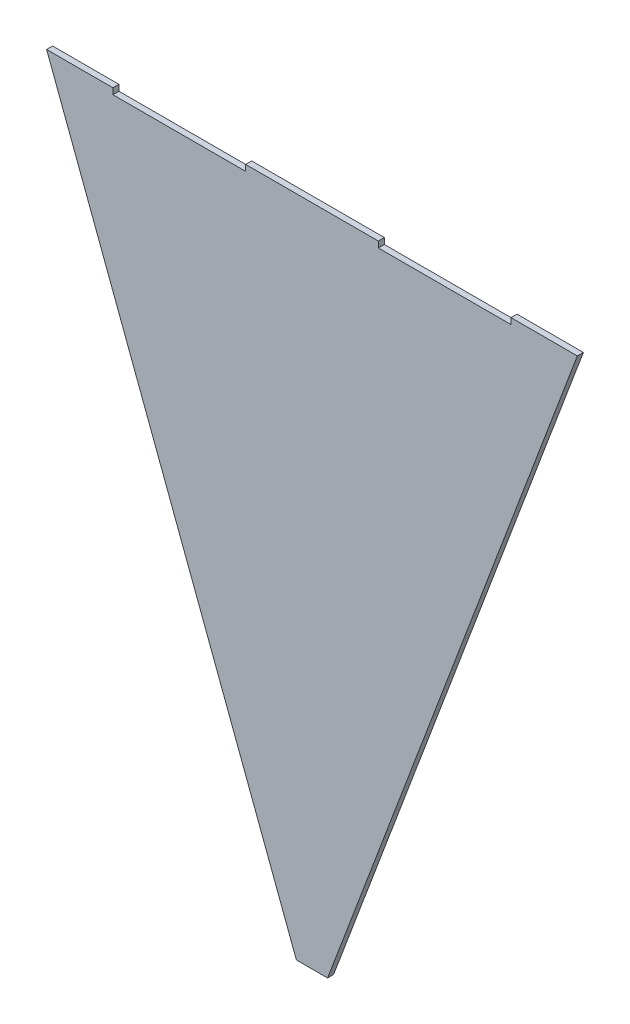
ISO-10303-21;
HEADER;
FILE_DESCRIPTION(('STEP AP214'),'2;1');
FILE_NAME('part.step','',(''),(''),'','','');
FILE_SCHEMA(('AUTOMOTIVE_DESIGN { 1 0 10303 214 1 1 1 1 }'));
ENDSEC;
DATA;
#1=APPLICATION_CONTEXT('core data for automotive mechanical design processes');
#2=APPLICATION_PROTOCOL_DEFINITION('international standard','automotive_design',2000,#1);
#3=PRODUCT_CONTEXT('',#1,'mechanical');
#4=PRODUCT('Part','Part','',(#3));
#5=PRODUCT_RELATED_PRODUCT_CATEGORY('part','',(#4));
#6=PRODUCT_DEFINITION_FORMATION('','',#4);
#7=PRODUCT_DEFINITION_CONTEXT('part definition',#1,'design');
#8=PRODUCT_DEFINITION('design','',#6,#7);
#9=PRODUCT_DEFINITION_SHAPE('','',#8);
#10=(LENGTH_UNIT() NAMED_UNIT(*) SI_UNIT(.MILLI.,.METRE.));
#11=(NAMED_UNIT(*) PLANE_ANGLE_UNIT() SI_UNIT($,.RADIAN.));
#12=(NAMED_UNIT(*) SI_UNIT($,.STERADIAN.) SOLID_ANGLE_UNIT());
#13=UNCERTAINTY_MEASURE_WITH_UNIT(LENGTH_MEASURE(1.E-05),#10,'distance_accuracy_value','');
#14=(GEOMETRIC_REPRESENTATION_CONTEXT(3) GLOBAL_UNCERTAINTY_ASSIGNED_CONTEXT((#13)) GLOBAL_UNIT_ASSIGNED_CONTEXT((#10,
#11,#12)) REPRESENTATION_CONTEXT('',''));
#15=CARTESIAN_POINT('',(0.,0.,0.));
#16=DIRECTION('',(0.,0.,1.));
#17=DIRECTION('',(1.,0.,0.));
#18=AXIS2_PLACEMENT_3D('',#15,#16,#17);
#19=CARTESIAN_POINT('',(-132.0301910025,440.215614172419,4.));
#20=DIRECTION('',(-1.,0.,0.));
#21=DIRECTION('',(0.,0.,1.));
#22=AXIS2_PLACEMENT_3D('',#19,#20,#21);
#23=PLANE('',#22);
#24=DIRECTION('',(0.,1.,0.));
#25=VECTOR('',#24,1.);
#26=CARTESIAN_POINT('',(-132.0301910025,440.215614172419,0.));
#27=LINE('',#26,#25);
#28=CARTESIAN_POINT('',(-132.0301910025,436.215614172419,0.));
#29=VERTEX_POINT('',#28);
#30=CARTESIAN_POINT('',(-132.0301910025,440.215614172419,0.));
#31=VERTEX_POINT('',#30);
#32=EDGE_CURVE('E153',#29,#31,#27,.T.);
#33=ORIENTED_EDGE('',*,*,#32,.T.);
#34=DIRECTION('',(0.,0.,-1.));
#35=VECTOR('',#34,1.);
#36=CARTESIAN_POINT('',(-132.0301910025,440.215614172419,4.));
#37=LINE('',#36,#35);
#38=CARTESIAN_POINT('',(-132.0301910025,440.215614172419,4.));
#39=VERTEX_POINT('',#38);
#40=EDGE_CURVE('E11',#39,#31,#37,.T.);
#41=ORIENTED_EDGE('',*,*,#40,.F.);
#42=DIRECTION('',(0.,1.,0.));
#43=VECTOR('',#42,1.);
#44=CARTESIAN_POINT('',(-132.0301910025,440.215614172419,4.));
#45=LINE('',#44,#43);
#46=CARTESIAN_POINT('',(-132.0301910025,436.215614172419,4.));
#47=VERTEX_POINT('',#46);
#48=EDGE_CURVE('E175',#47,#39,#45,.T.);
#49=ORIENTED_EDGE('',*,*,#48,.F.);
#50=DIRECTION('',(0.,0.,-1.));
#51=VECTOR('',#50,1.);
#52=CARTESIAN_POINT('',(-132.0301910025,436.215614172419,4.));
#53=LINE('',#52,#51);
#54=EDGE_CURVE('E149',#47,#29,#53,.T.);
#55=ORIENTED_EDGE('',*,*,#54,.T.);
#56=EDGE_LOOP('',(#33,#41,#49,#55));
#57=FACE_BOUND('',#56,.T.);
#58=ADVANCED_FACE('F33',(#57),#23,.F.);
#59=CARTESIAN_POINT('',(-176.040382005,440.215614172419,4.));
#60=DIRECTION('',(0.,-1.,0.));
#61=DIRECTION('',(0.,0.,-1.));
#62=AXIS2_PLACEMENT_3D('',#59,#60,#61);
#63=PLANE('',#62);
#64=DIRECTION('',(-1.,0.,0.));
#65=VECTOR('',#64,1.);
#66=CARTESIAN_POINT('',(-176.040382005,440.215614172419,0.));
#67=LINE('',#66,#65);
#68=CARTESIAN_POINT('',(-176.040382005,440.215614172419,0.));
#69=VERTEX_POINT('',#68);
#70=EDGE_CURVE('E156',#31,#69,#67,.T.);
#71=ORIENTED_EDGE('',*,*,#70,.T.);
#72=DIRECTION('',(0.,0.,-1.));
#73=VECTOR('',#72,1.);
#74=CARTESIAN_POINT('',(-176.040382005,440.215614172419,4.));
#75=LINE('',#74,#73);
#76=CARTESIAN_POINT('',(-176.040382005,440.215614172419,4.));
#77=VERTEX_POINT('',#76);
#78=EDGE_CURVE('E41',#77,#69,#75,.T.);
#79=ORIENTED_EDGE('',*,*,#78,.F.);
#80=DIRECTION('',(-1.,0.,0.));
#81=VECTOR('',#80,1.);
#82=CARTESIAN_POINT('',(-176.040382005,440.215614172419,4.));
#83=LINE('',#82,#81);
#84=EDGE_CURVE('E104',#39,#77,#83,.T.);
#85=ORIENTED_EDGE('',*,*,#84,.F.);
#86=ORIENTED_EDGE('',*,*,#40,.T.);
#87=EDGE_LOOP('',(#71,#79,#85,#86));
#88=FACE_BOUND('',#87,.T.);
#89=ADVANCED_FACE('F253',(#88),#63,.F.);
#90=CARTESIAN_POINT('',(-10.35533906,0.,4.));
#91=DIRECTION('',(0.935906194500633,0.352249336543511,0.));
#92=DIRECTION('',(-0.352249336543511,0.935906194500633,0.));
#93=AXIS2_PLACEMENT_3D('',#90,#91,#92);
#94=PLANE('',#93);
#95=DIRECTION('',(0.352249336543511,-0.935906194500633,0.));
#96=VECTOR('',#95,1.);
#97=CARTESIAN_POINT('',(-10.35533906,0.,0.));
#98=LINE('',#97,#96);
#99=CARTESIAN_POINT('',(-10.35533906,0.,0.));
#100=VERTEX_POINT('',#99);
#101=EDGE_CURVE('E158',#69,#100,#98,.T.);
#102=ORIENTED_EDGE('',*,*,#101,.T.);
#103=DIRECTION('',(0.,0.,-1.));
#104=VECTOR('',#103,1.);
#105=CARTESIAN_POINT('',(-10.35533906,0.,4.));
#106=LINE('',#105,#104);
#107=CARTESIAN_POINT('',(-10.35533906,0.,4.));
#108=VERTEX_POINT('',#107);
#109=EDGE_CURVE('E194',#108,#100,#106,.T.);
#110=ORIENTED_EDGE('',*,*,#109,.F.);
#111=DIRECTION('',(0.352249336543511,-0.935906194500633,0.));
#112=VECTOR('',#111,1.);
#113=CARTESIAN_POINT('',(-10.35533906,0.,4.));
#114=LINE('',#113,#112);
#115=EDGE_CURVE('E202',#77,#108,#114,.T.);
#116=ORIENTED_EDGE('',*,*,#115,.F.);
#117=ORIENTED_EDGE('',*,*,#78,.T.);
#118=EDGE_LOOP('',(#102,#110,#116,#117));
#119=FACE_BOUND('',#118,.T.);
#120=ADVANCED_FACE('F200',(#119),#94,.F.);
#121=CARTESIAN_POINT('',(10.35533906,0.,4.));
#122=DIRECTION('',(0.,1.,0.));
#123=DIRECTION('',(-1.,0.,0.));
#124=AXIS2_PLACEMENT_3D('',#121,#122,#123);
#125=PLANE('',#124);
#126=DIRECTION('',(1.,0.,0.));
#127=VECTOR('',#126,1.);
#128=CARTESIAN_POINT('',(10.35533906,0.,0.));
#129=LINE('',#128,#127);
#130=CARTESIAN_POINT('',(10.35533906,0.,0.));
#131=VERTEX_POINT('',#130);
#132=EDGE_CURVE('E160',#100,#131,#129,.T.);
#133=ORIENTED_EDGE('',*,*,#132,.T.);
#134=DIRECTION('',(0.,0.,-1.));
#135=VECTOR('',#134,1.);
#136=CARTESIAN_POINT('',(10.35533906,0.,4.));
#137=LINE('',#136,#135);
#138=CARTESIAN_POINT('',(10.35533906,0.,4.));
#139=VERTEX_POINT('',#138);
#140=EDGE_CURVE('E191',#139,#131,#137,.T.);
#141=ORIENTED_EDGE('',*,*,#140,.F.);
#142=DIRECTION('',(1.,0.,0.));
#143=VECTOR('',#142,1.);
#144=CARTESIAN_POINT('',(10.35533906,0.,4.));
#145=LINE('',#144,#143);
#146=EDGE_CURVE('E220',#108,#139,#145,.T.);
#147=ORIENTED_EDGE('',*,*,#146,.F.);
#148=ORIENTED_EDGE('',*,*,#109,.T.);
#149=EDGE_LOOP('',(#133,#141,#147,#148));
#150=FACE_BOUND('',#149,.T.);
#151=ADVANCED_FACE('F211',(#150),#125,.F.);
#152=CARTESIAN_POINT('',(176.041146015,440.215614172419,4.));
#153=DIRECTION('',(-0.93590565901348,0.352250759298748,0.));
#154=DIRECTION('',(-0.352250759298748,-0.93590565901348,0.));
#155=AXIS2_PLACEMENT_3D('',#152,#153,#154);
#156=PLANE('',#155);
#157=DIRECTION('',(0.352250759298748,0.93590565901348,0.));
#158=VECTOR('',#157,1.);
#159=CARTESIAN_POINT('',(176.041146015,440.215614172419,0.));
#160=LINE('',#159,#158);
#161=CARTESIAN_POINT('',(176.041146015,440.215614172419,0.));
#162=VERTEX_POINT('',#161);
#163=EDGE_CURVE('E162',#131,#162,#160,.T.);
#164=ORIENTED_EDGE('',*,*,#163,.T.);
#165=DIRECTION('',(0.,0.,-1.));
#166=VECTOR('',#165,1.);
#167=CARTESIAN_POINT('',(176.041146015,440.215614172419,4.));
#168=LINE('',#167,#166);
#169=CARTESIAN_POINT('',(176.041146015,440.215614172419,4.));
#170=VERTEX_POINT('',#169);
#171=EDGE_CURVE('E188',#170,#162,#168,.T.);
#172=ORIENTED_EDGE('',*,*,#171,.F.);
#173=DIRECTION('',(0.352250759298748,0.93590565901348,0.));
#174=VECTOR('',#173,1.);
#175=CARTESIAN_POINT('',(176.041146015,440.215614172419,4.));
#176=LINE('',#175,#174);
#177=EDGE_CURVE('E217',#139,#170,#176,.T.);
#178=ORIENTED_EDGE('',*,*,#177,.F.);
#179=ORIENTED_EDGE('',*,*,#140,.T.);
#180=EDGE_LOOP('',(#164,#172,#178,#179));
#181=FACE_BOUND('',#180,.T.);
#182=ADVANCED_FACE('F215',(#181),#156,.F.);
#183=CARTESIAN_POINT('',(132.0301910025,440.215614172419,4.));
#184=DIRECTION('',(0.,-1.,0.));
#185=DIRECTION('',(0.,0.,-1.));
#186=AXIS2_PLACEMENT_3D('',#183,#184,#185);
#187=PLANE('',#186);
#188=DIRECTION('',(-1.,0.,0.));
#189=VECTOR('',#188,1.);
#190=CARTESIAN_POINT('',(132.0301910025,440.215614172419,0.));
#191=LINE('',#190,#189);
#192=CARTESIAN_POINT('',(132.0301910025,440.215614172419,0.));
#193=VERTEX_POINT('',#192);
#194=EDGE_CURVE('E164',#162,#193,#191,.T.);
#195=ORIENTED_EDGE('',*,*,#194,.T.);
#196=DIRECTION('',(0.,0.,-1.));
#197=VECTOR('',#196,1.);
#198=CARTESIAN_POINT('',(132.0301910025,440.215614172419,4.));
#199=LINE('',#198,#197);
#200=CARTESIAN_POINT('',(132.0301910025,440.215614172419,4.));
#201=VERTEX_POINT('',#200);
#202=EDGE_CURVE('E185',#201,#193,#199,.T.);
#203=ORIENTED_EDGE('',*,*,#202,.F.);
#204=DIRECTION('',(-1.,0.,0.));
#205=VECTOR('',#204,1.);
#206=CARTESIAN_POINT('',(132.0301910025,440.215614172419,4.));
#207=LINE('',#206,#205);
#208=EDGE_CURVE('E219',#170,#201,#207,.T.);
#209=ORIENTED_EDGE('',*,*,#208,.F.);
#210=ORIENTED_EDGE('',*,*,#171,.T.);
#211=EDGE_LOOP('',(#195,#203,#209,#210));
#212=FACE_BOUND('',#211,.T.);
#213=ADVANCED_FACE('F266',(#212),#187,.F.);
#214=CARTESIAN_POINT('',(132.0301910025,436.215614172419,4.));
#215=DIRECTION('',(1.,0.,0.));
#216=DIRECTION('',(0.,0.,-1.));
#217=AXIS2_PLACEMENT_3D('',#214,#215,#216);
#218=PLANE('',#217);
#219=DIRECTION('',(0.,-1.,0.));
#220=VECTOR('',#219,1.);
#221=CARTESIAN_POINT('',(132.0301910025,436.215614172419,0.));
#222=LINE('',#221,#220);
#223=CARTESIAN_POINT('',(132.0301910025,436.215614172419,0.));
#224=VERTEX_POINT('',#223);
#225=EDGE_CURVE('E166',#193,#224,#222,.T.);
#226=ORIENTED_EDGE('',*,*,#225,.T.);
#227=DIRECTION('',(0.,0.,-1.));
#228=VECTOR('',#227,1.);
#229=CARTESIAN_POINT('',(132.0301910025,436.215614172419,4.));
#230=LINE('',#229,#228);
#231=CARTESIAN_POINT('',(132.0301910025,436.215614172419,4.));
#232=VERTEX_POINT('',#231);
#233=EDGE_CURVE('E182',#232,#224,#230,.T.);
#234=ORIENTED_EDGE('',*,*,#233,.F.);
#235=DIRECTION('',(0.,-1.,0.));
#236=VECTOR('',#235,1.);
#237=CARTESIAN_POINT('',(132.0301910025,436.215614172419,4.));
#238=LINE('',#237,#236);
#239=EDGE_CURVE('E222',#201,#232,#238,.T.);
#240=ORIENTED_EDGE('',*,*,#239,.F.);
#241=ORIENTED_EDGE('',*,*,#202,.T.);
#242=EDGE_LOOP('',(#226,#234,#240,#241));
#243=FACE_BOUND('',#242,.T.);
#244=ADVANCED_FACE('F269',(#243),#218,.F.);
#245=CARTESIAN_POINT('',(44.0098089975,436.215614172419,4.));
#246=DIRECTION('',(0.,-1.,0.));
#247=DIRECTION('',(0.,0.,-1.));
#248=AXIS2_PLACEMENT_3D('',#245,#246,#247);
#249=PLANE('',#248);
#250=DIRECTION('',(-1.,0.,0.));
#251=VECTOR('',#250,1.);
#252=CARTESIAN_POINT('',(44.0098089975,436.215614172419,0.));
#253=LINE('',#252,#251);
#254=CARTESIAN_POINT('',(44.0098089975,436.215614172419,0.));
#255=VERTEX_POINT('',#254);
#256=EDGE_CURVE('E168',#224,#255,#253,.T.);
#257=ORIENTED_EDGE('',*,*,#256,.T.);
#258=DIRECTION('',(0.,0.,-1.));
#259=VECTOR('',#258,1.);
#260=CARTESIAN_POINT('',(44.0098089975,436.215614172419,4.));
#261=LINE('',#260,#259);
#262=CARTESIAN_POINT('',(44.0098089975,436.215614172419,4.));
#263=VERTEX_POINT('',#262);
#264=EDGE_CURVE('E179',#263,#255,#261,.T.);
#265=ORIENTED_EDGE('',*,*,#264,.F.);
#266=DIRECTION('',(-1.,0.,0.));
#267=VECTOR('',#266,1.);
#268=CARTESIAN_POINT('',(44.0098089975,436.215614172419,4.));
#269=LINE('',#268,#267);
#270=EDGE_CURVE('E228',#232,#263,#269,.T.);
#271=ORIENTED_EDGE('',*,*,#270,.F.);
#272=ORIENTED_EDGE('',*,*,#233,.T.);
#273=EDGE_LOOP('',(#257,#265,#271,#272));
#274=FACE_BOUND('',#273,.T.);
#275=ADVANCED_FACE('F234',(#274),#249,.F.);
#276=CARTESIAN_POINT('',(44.0098089975,440.215614172419,4.));
#277=DIRECTION('',(-1.,0.,0.));
#278=DIRECTION('',(0.,0.,1.));
#279=AXIS2_PLACEMENT_3D('',#276,#277,#278);
#280=PLANE('',#279);
#281=DIRECTION('',(0.,1.,0.));
#282=VECTOR('',#281,1.);
#283=CARTESIAN_POINT('',(44.0098089975,440.215614172419,0.));
#284=LINE('',#283,#282);
#285=CARTESIAN_POINT('',(44.0098089975,440.215614172419,0.));
#286=VERTEX_POINT('',#285);
#287=EDGE_CURVE('E170',#255,#286,#284,.T.);
#288=ORIENTED_EDGE('',*,*,#287,.T.);
#289=DIRECTION('',(0.,0.,-1.));
#290=VECTOR('',#289,1.);
#291=CARTESIAN_POINT('',(44.0098089975,440.215614172419,4.));
#292=LINE('',#291,#290);
#293=CARTESIAN_POINT('',(44.0098089975,440.215614172419,4.));
#294=VERTEX_POINT('',#293);
#295=EDGE_CURVE('E144',#294,#286,#292,.T.);
#296=ORIENTED_EDGE('',*,*,#295,.F.);
#297=DIRECTION('',(0.,1.,0.));
#298=VECTOR('',#297,1.);
#299=CARTESIAN_POINT('',(44.0098089975,440.215614172419,4.));
#300=LINE('',#299,#298);
#301=EDGE_CURVE('E135',#263,#294,#300,.T.);
#302=ORIENTED_EDGE('',*,*,#301,.F.);
#303=ORIENTED_EDGE('',*,*,#264,.T.);
#304=EDGE_LOOP('',(#288,#296,#302,#303));
#305=FACE_BOUND('',#304,.T.);
#306=ADVANCED_FACE('F238',(#305),#280,.F.);
#307=CARTESIAN_POINT('',(-44.0098089975,440.215614172419,4.));
#308=DIRECTION('',(0.,-1.,0.));
#309=DIRECTION('',(0.,0.,-1.));
#310=AXIS2_PLACEMENT_3D('',#307,#308,#309);
#311=PLANE('',#310);
#312=DIRECTION('',(-1.,0.,0.));
#313=VECTOR('',#312,1.);
#314=CARTESIAN_POINT('',(-44.0098089975,440.215614172419,0.));
#315=LINE('',#314,#313);
#316=CARTESIAN_POINT('',(-44.0098089975,440.215614172419,0.));
#317=VERTEX_POINT('',#316);
#318=EDGE_CURVE('E143',#286,#317,#315,.T.);
#319=ORIENTED_EDGE('',*,*,#318,.T.);
#320=DIRECTION('',(0.,0.,-1.));
#321=VECTOR('',#320,1.);
#322=CARTESIAN_POINT('',(-44.0098089975,440.215614172419,4.));
#323=LINE('',#322,#321);
#324=CARTESIAN_POINT('',(-44.0098089975,440.215614172419,4.));
#325=VERTEX_POINT('',#324);
#326=EDGE_CURVE('E140',#325,#317,#323,.T.);
#327=ORIENTED_EDGE('',*,*,#326,.F.);
#328=DIRECTION('',(-1.,0.,0.));
#329=VECTOR('',#328,1.);
#330=CARTESIAN_POINT('',(-44.0098089975,440.215614172419,4.));
#331=LINE('',#330,#329);
#332=EDGE_CURVE('E129',#294,#325,#331,.T.);
#333=ORIENTED_EDGE('',*,*,#332,.F.);
#334=ORIENTED_EDGE('',*,*,#295,.T.);
#335=EDGE_LOOP('',(#319,#327,#333,#334));
#336=FACE_BOUND('',#335,.T.);
#337=ADVANCED_FACE('F141',(#336),#311,.F.);
#338=CARTESIAN_POINT('',(-44.0098089975,436.215614172419,4.));
#339=DIRECTION('',(1.,0.,0.));
#340=DIRECTION('',(0.,0.,-1.));
#341=AXIS2_PLACEMENT_3D('',#338,#339,#340);
#342=PLANE('',#341);
#343=DIRECTION('',(0.,-1.,0.));
#344=VECTOR('',#343,1.);
#345=CARTESIAN_POINT('',(-44.0098089975,436.215614172419,0.));
#346=LINE('',#345,#344);
#347=CARTESIAN_POINT('',(-44.0098089975,436.215614172419,0.));
#348=VERTEX_POINT('',#347);
#349=EDGE_CURVE('E90',#317,#348,#346,.T.);
#350=ORIENTED_EDGE('',*,*,#349,.T.);
#351=DIRECTION('',(0.,0.,-1.));
#352=VECTOR('',#351,1.);
#353=CARTESIAN_POINT('',(-44.0098089975,436.215614172419,4.));
#354=LINE('',#353,#352);
#355=CARTESIAN_POINT('',(-44.0098089975,436.215614172419,4.));
#356=VERTEX_POINT('',#355);
#357=EDGE_CURVE('E145',#356,#348,#354,.T.);
#358=ORIENTED_EDGE('',*,*,#357,.F.);
#359=DIRECTION('',(0.,-1.,0.));
#360=VECTOR('',#359,1.);
#361=CARTESIAN_POINT('',(-44.0098089975,436.215614172419,4.));
#362=LINE('',#361,#360);
#363=EDGE_CURVE('E133',#325,#356,#362,.T.);
#364=ORIENTED_EDGE('',*,*,#363,.F.);
#365=ORIENTED_EDGE('',*,*,#326,.T.);
#366=EDGE_LOOP('',(#350,#358,#364,#365));
#367=FACE_BOUND('',#366,.T.);
#368=ADVANCED_FACE('F147',(#367),#342,.F.);
#369=CARTESIAN_POINT('',(-132.0301910025,436.215614172419,4.));
#370=DIRECTION('',(0.,-1.,0.));
#371=DIRECTION('',(0.,0.,-1.));
#372=AXIS2_PLACEMENT_3D('',#369,#370,#371);
#373=PLANE('',#372);
#374=DIRECTION('',(-1.,0.,0.));
#375=VECTOR('',#374,1.);
#376=CARTESIAN_POINT('',(-132.0301910025,436.215614172419,0.));
#377=LINE('',#376,#375);
#378=EDGE_CURVE('E96',#348,#29,#377,.T.);
#379=ORIENTED_EDGE('',*,*,#378,.T.);
#380=ORIENTED_EDGE('',*,*,#54,.F.);
#381=DIRECTION('',(-1.,0.,0.));
#382=VECTOR('',#381,1.);
#383=CARTESIAN_POINT('',(-132.0301910025,436.215614172419,4.));
#384=LINE('',#383,#382);
#385=EDGE_CURVE('E49',#356,#47,#384,.T.);
#386=ORIENTED_EDGE('',*,*,#385,.F.);
#387=ORIENTED_EDGE('',*,*,#357,.T.);
#388=EDGE_LOOP('',(#379,#380,#386,#387));
#389=FACE_BOUND('',#388,.T.);
#390=ADVANCED_FACE('F242',(#389),#373,.F.);
#391=CARTESIAN_POINT('',(0.,0.,4.));
#392=DIRECTION('',(0.,0.,1.));
#393=DIRECTION('',(1.,0.,0.));
#394=AXIS2_PLACEMENT_3D('',#391,#392,#393);
#395=PLANE('',#394);
#396=ORIENTED_EDGE('',*,*,#48,.T.);
#397=ORIENTED_EDGE('',*,*,#84,.T.);
#398=ORIENTED_EDGE('',*,*,#115,.T.);
#399=ORIENTED_EDGE('',*,*,#146,.T.);
#400=ORIENTED_EDGE('',*,*,#177,.T.);
#401=ORIENTED_EDGE('',*,*,#208,.T.);
#402=ORIENTED_EDGE('',*,*,#239,.T.);
#403=ORIENTED_EDGE('',*,*,#270,.T.);
#404=ORIENTED_EDGE('',*,*,#301,.T.);
#405=ORIENTED_EDGE('',*,*,#332,.T.);
#406=ORIENTED_EDGE('',*,*,#363,.T.);
#407=ORIENTED_EDGE('',*,*,#385,.T.);
#408=EDGE_LOOP('',(#396,#397,#398,#399,#400,#401,#402,#403,#404,#405,#406,#407));
#409=FACE_BOUND('',#408,.T.);
#410=ADVANCED_FACE('F131',(#409),#395,.T.);
#411=CARTESIAN_POINT('',(0.,0.,0.));
#412=DIRECTION('',(0.,0.,1.));
#413=DIRECTION('',(1.,0.,0.));
#414=AXIS2_PLACEMENT_3D('',#411,#412,#413);
#415=PLANE('',#414);
#416=ORIENTED_EDGE('',*,*,#32,.F.);
#417=ORIENTED_EDGE('',*,*,#378,.F.);
#418=ORIENTED_EDGE('',*,*,#349,.F.);
#419=ORIENTED_EDGE('',*,*,#318,.F.);
#420=ORIENTED_EDGE('',*,*,#287,.F.);
#421=ORIENTED_EDGE('',*,*,#256,.F.);
#422=ORIENTED_EDGE('',*,*,#225,.F.);
#423=ORIENTED_EDGE('',*,*,#194,.F.);
#424=ORIENTED_EDGE('',*,*,#163,.F.);
#425=ORIENTED_EDGE('',*,*,#132,.F.);
#426=ORIENTED_EDGE('',*,*,#101,.F.);
#427=ORIENTED_EDGE('',*,*,#70,.F.);
#428=EDGE_LOOP('',(#416,#417,#418,#419,#420,#421,#422,#423,#424,#425,#426,#427));
#429=FACE_BOUND('',#428,.T.);
#430=ADVANCED_FACE('F206',(#429),#415,.F.);
#431=CLOSED_SHELL('',(#58,#89,#120,#151,#182,#213,#244,#275,#306,#337,#368,#390,#410,#430));
#432=MANIFOLD_SOLID_BREP('B2',#431);
#433=ADVANCED_BREP_SHAPE_REPRESENTATION('',(#18,#432),#14);
#434=SHAPE_DEFINITION_REPRESENTATION(#9,#433);
ENDSEC;
END-ISO-10303-21;
